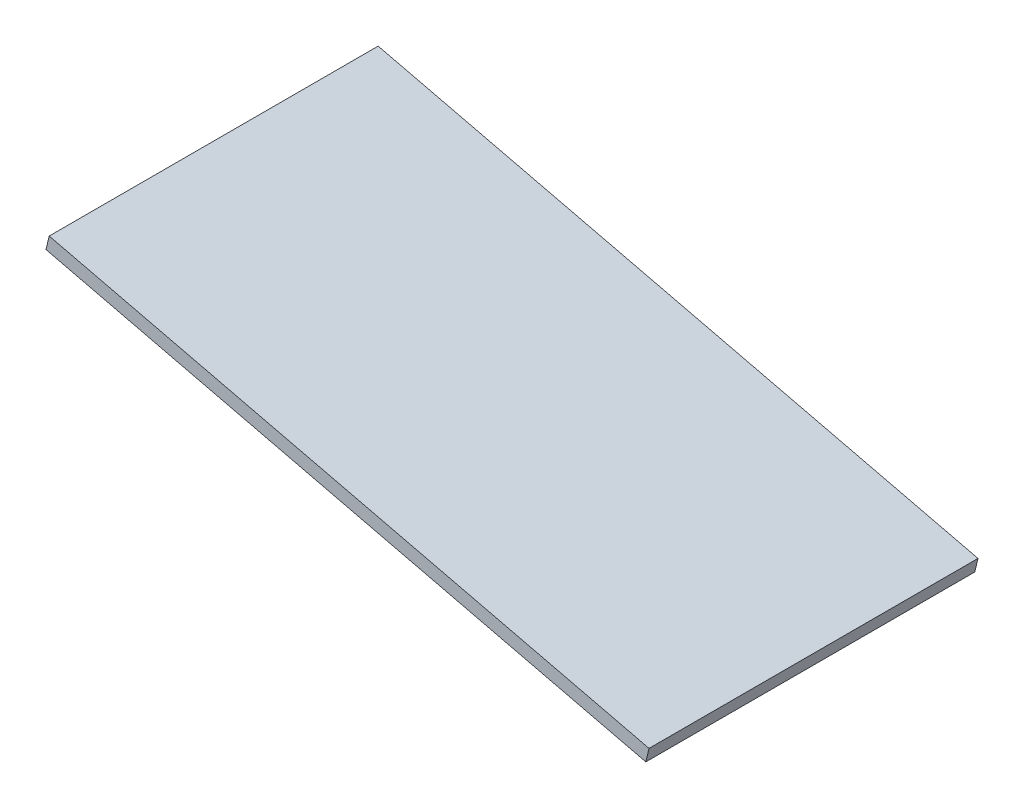
ISO-10303-21;
HEADER;
FILE_DESCRIPTION(('STEP AP214'),'2;1');
FILE_NAME('part.step','',(''),(''),'','','');
FILE_SCHEMA(('AUTOMOTIVE_DESIGN { 1 0 10303 214 1 1 1 1 }'));
ENDSEC;
DATA;
#1=APPLICATION_CONTEXT('core data for automotive mechanical design processes');
#2=APPLICATION_PROTOCOL_DEFINITION('international standard','automotive_design',2000,#1);
#3=PRODUCT_CONTEXT('',#1,'mechanical');
#4=PRODUCT('Part','Part','',(#3));
#5=PRODUCT_RELATED_PRODUCT_CATEGORY('part','',(#4));
#6=PRODUCT_DEFINITION_FORMATION('','',#4);
#7=PRODUCT_DEFINITION_CONTEXT('part definition',#1,'design');
#8=PRODUCT_DEFINITION('design','',#6,#7);
#9=PRODUCT_DEFINITION_SHAPE('','',#8);
#10=(LENGTH_UNIT() NAMED_UNIT(*) SI_UNIT(.MILLI.,.METRE.));
#11=(NAMED_UNIT(*) PLANE_ANGLE_UNIT() SI_UNIT($,.RADIAN.));
#12=(NAMED_UNIT(*) SI_UNIT($,.STERADIAN.) SOLID_ANGLE_UNIT());
#13=UNCERTAINTY_MEASURE_WITH_UNIT(LENGTH_MEASURE(1.E-05),#10,'distance_accuracy_value','');
#14=(GEOMETRIC_REPRESENTATION_CONTEXT(3) GLOBAL_UNCERTAINTY_ASSIGNED_CONTEXT((#13)) GLOBAL_UNIT_ASSIGNED_CONTEXT((#10,
#11,#12)) REPRESENTATION_CONTEXT('',''));
#15=CARTESIAN_POINT('',(0.,0.,0.));
#16=DIRECTION('',(0.,0.,1.));
#17=DIRECTION('',(1.,0.,0.));
#18=AXIS2_PLACEMENT_3D('',#15,#16,#17);
#19=CARTESIAN_POINT('',(-91.8552763028846,555.673613358899,72.));
#20=DIRECTION('',(0.233089191440349,0.972455360843717,0.));
#21=DIRECTION('',(-0.972455360843718,0.233089191440349,0.));
#22=AXIS2_PLACEMENT_3D('',#19,#20,#21);
#23=PLANE('',#22);
#24=DIRECTION('',(0.972455360843717,-0.233089191440349,0.));
#25=VECTOR('',#24,1.);
#26=CARTESIAN_POINT('',(-91.8552763028846,555.673613358899,0.));
#27=LINE('',#26,#25);
#28=CARTESIAN_POINT('',(-91.8552763028846,555.673613358899,0.));
#29=VERTEX_POINT('',#28);
#30=CARTESIAN_POINT('',(39.4261974110173,524.206572514452,0.));
#31=VERTEX_POINT('',#30);
#32=EDGE_CURVE('E98',#29,#31,#27,.T.);
#33=ORIENTED_EDGE('',*,*,#32,.T.);
#34=DIRECTION('',(0.,0.,-1.));
#35=VECTOR('',#34,1.);
#36=CARTESIAN_POINT('',(39.4261974110173,524.206572514452,72.));
#37=LINE('',#36,#35);
#38=CARTESIAN_POINT('',(39.4261974110173,524.206572514452,72.));
#39=VERTEX_POINT('',#38);
#40=EDGE_CURVE('E11',#39,#31,#37,.T.);
#41=ORIENTED_EDGE('',*,*,#40,.F.);
#42=DIRECTION('',(0.972455360843717,-0.233089191440349,0.));
#43=VECTOR('',#42,1.);
#44=CARTESIAN_POINT('',(-91.8552763028846,555.673613358899,72.));
#45=LINE('',#44,#43);
#46=CARTESIAN_POINT('',(-91.8552763028846,555.673613358899,72.));
#47=VERTEX_POINT('',#46);
#48=EDGE_CURVE('E86',#47,#39,#45,.T.);
#49=ORIENTED_EDGE('',*,*,#48,.F.);
#50=DIRECTION('',(0.,0.,-1.));
#51=VECTOR('',#50,1.);
#52=CARTESIAN_POINT('',(-91.8552763028846,555.673613358899,72.));
#53=LINE('',#52,#51);
#54=EDGE_CURVE('E94',#47,#29,#53,.T.);
#55=ORIENTED_EDGE('',*,*,#54,.T.);
#56=EDGE_LOOP('',(#33,#41,#49,#55));
#57=FACE_BOUND('',#56,.T.);
#58=ADVANCED_FACE('F35',(#57),#23,.F.);
#59=CARTESIAN_POINT('',(39.4261974110173,524.206572514452,72.));
#60=DIRECTION('',(-0.972455360843717,0.233089191440351,0.));
#61=DIRECTION('',(-0.233089191440351,-0.972455360843717,0.));
#62=AXIS2_PLACEMENT_3D('',#59,#60,#61);
#63=PLANE('',#62);
#64=DIRECTION('',(0.233089191440351,0.972455360843717,0.));
#65=VECTOR('',#64,1.);
#66=CARTESIAN_POINT('',(39.4261974110173,524.206572514452,0.));
#67=LINE('',#66,#65);
#68=CARTESIAN_POINT('',(40.1254649853384,527.123938596983,0.));
#69=VERTEX_POINT('',#68);
#70=EDGE_CURVE('E90',#31,#69,#67,.T.);
#71=ORIENTED_EDGE('',*,*,#70,.T.);
#72=DIRECTION('',(0.,0.,-1.));
#73=VECTOR('',#72,1.);
#74=CARTESIAN_POINT('',(40.1254649853384,527.123938596983,72.));
#75=LINE('',#74,#73);
#76=CARTESIAN_POINT('',(40.1254649853384,527.123938596983,72.));
#77=VERTEX_POINT('',#76);
#78=EDGE_CURVE('E43',#77,#69,#75,.T.);
#79=ORIENTED_EDGE('',*,*,#78,.F.);
#80=DIRECTION('',(0.233089191440351,0.972455360843717,0.));
#81=VECTOR('',#80,1.);
#82=CARTESIAN_POINT('',(39.4261974110173,524.206572514452,72.));
#83=LINE('',#82,#81);
#84=EDGE_CURVE('E81',#39,#77,#83,.T.);
#85=ORIENTED_EDGE('',*,*,#84,.F.);
#86=ORIENTED_EDGE('',*,*,#40,.T.);
#87=EDGE_LOOP('',(#71,#79,#85,#86));
#88=FACE_BOUND('',#87,.T.);
#89=ADVANCED_FACE('F89',(#88),#63,.F.);
#90=CARTESIAN_POINT('',(-91.1560087285635,558.59097944143,72.));
#91=DIRECTION('',(-0.233089191440349,-0.972455360843717,0.));
#92=DIRECTION('',(0.972455360843718,-0.233089191440349,0.));
#93=AXIS2_PLACEMENT_3D('',#90,#91,#92);
#94=PLANE('',#93);
#95=DIRECTION('',(-0.972455360843717,0.233089191440349,0.));
#96=VECTOR('',#95,1.);
#97=CARTESIAN_POINT('',(-91.1560087285635,558.59097944143,0.));
#98=LINE('',#97,#96);
#99=CARTESIAN_POINT('',(-91.1560087285635,558.59097944143,0.));
#100=VERTEX_POINT('',#99);
#101=EDGE_CURVE('E68',#69,#100,#98,.T.);
#102=ORIENTED_EDGE('',*,*,#101,.T.);
#103=DIRECTION('',(0.,0.,-1.));
#104=VECTOR('',#103,1.);
#105=CARTESIAN_POINT('',(-91.1560087285635,558.59097944143,72.));
#106=LINE('',#105,#104);
#107=CARTESIAN_POINT('',(-91.1560087285635,558.59097944143,72.));
#108=VERTEX_POINT('',#107);
#109=EDGE_CURVE('E91',#108,#100,#106,.T.);
#110=ORIENTED_EDGE('',*,*,#109,.F.);
#111=DIRECTION('',(-0.972455360843717,0.233089191440349,0.));
#112=VECTOR('',#111,1.);
#113=CARTESIAN_POINT('',(-91.1560087285635,558.59097944143,72.));
#114=LINE('',#113,#112);
#115=EDGE_CURVE('E84',#77,#108,#114,.T.);
#116=ORIENTED_EDGE('',*,*,#115,.F.);
#117=ORIENTED_EDGE('',*,*,#78,.T.);
#118=EDGE_LOOP('',(#102,#110,#116,#117));
#119=FACE_BOUND('',#118,.T.);
#120=ADVANCED_FACE('F92',(#119),#94,.F.);
#121=CARTESIAN_POINT('',(-91.8552763028846,555.673613358899,72.));
#122=DIRECTION('',(0.972455360843717,-0.233089191440348,0.));
#123=DIRECTION('',(0.233089191440348,0.972455360843718,0.));
#124=AXIS2_PLACEMENT_3D('',#121,#122,#123);
#125=PLANE('',#124);
#126=DIRECTION('',(-0.233089191440348,-0.972455360843717,0.));
#127=VECTOR('',#126,1.);
#128=CARTESIAN_POINT('',(-91.8552763028846,555.673613358899,0.));
#129=LINE('',#128,#127);
#130=EDGE_CURVE('E74',#100,#29,#129,.T.);
#131=ORIENTED_EDGE('',*,*,#130,.T.);
#132=ORIENTED_EDGE('',*,*,#54,.F.);
#133=DIRECTION('',(-0.233089191440348,-0.972455360843717,0.));
#134=VECTOR('',#133,1.);
#135=CARTESIAN_POINT('',(-91.8552763028846,555.673613358899,72.));
#136=LINE('',#135,#134);
#137=EDGE_CURVE('E51',#108,#47,#136,.T.);
#138=ORIENTED_EDGE('',*,*,#137,.F.);
#139=ORIENTED_EDGE('',*,*,#109,.T.);
#140=EDGE_LOOP('',(#131,#132,#138,#139));
#141=FACE_BOUND('',#140,.T.);
#142=ADVANCED_FACE('F105',(#141),#125,.F.);
#143=CARTESIAN_POINT('',(0.,0.,72.));
#144=DIRECTION('',(0.,0.,1.));
#145=DIRECTION('',(1.,0.,0.));
#146=AXIS2_PLACEMENT_3D('',#143,#144,#145);
#147=PLANE('',#146);
#148=ORIENTED_EDGE('',*,*,#48,.T.);
#149=ORIENTED_EDGE('',*,*,#84,.T.);
#150=ORIENTED_EDGE('',*,*,#115,.T.);
#151=ORIENTED_EDGE('',*,*,#137,.T.);
#152=EDGE_LOOP('',(#148,#149,#150,#151));
#153=FACE_BOUND('',#152,.T.);
#154=ADVANCED_FACE('F82',(#153),#147,.T.);
#155=CARTESIAN_POINT('',(0.,0.,0.));
#156=DIRECTION('',(0.,0.,1.));
#157=DIRECTION('',(1.,0.,0.));
#158=AXIS2_PLACEMENT_3D('',#155,#156,#157);
#159=PLANE('',#158);
#160=ORIENTED_EDGE('',*,*,#32,.F.);
#161=ORIENTED_EDGE('',*,*,#130,.F.);
#162=ORIENTED_EDGE('',*,*,#101,.F.);
#163=ORIENTED_EDGE('',*,*,#70,.F.);
#164=EDGE_LOOP('',(#160,#161,#162,#163));
#165=FACE_BOUND('',#164,.T.);
#166=ADVANCED_FACE('F108',(#165),#159,.F.);
#167=CLOSED_SHELL('',(#58,#89,#120,#142,#154,#166));
#168=MANIFOLD_SOLID_BREP('B2',#167);
#169=ADVANCED_BREP_SHAPE_REPRESENTATION('',(#18,#168),#14);
#170=SHAPE_DEFINITION_REPRESENTATION(#9,#169);
ENDSEC;
END-ISO-10303-21;
